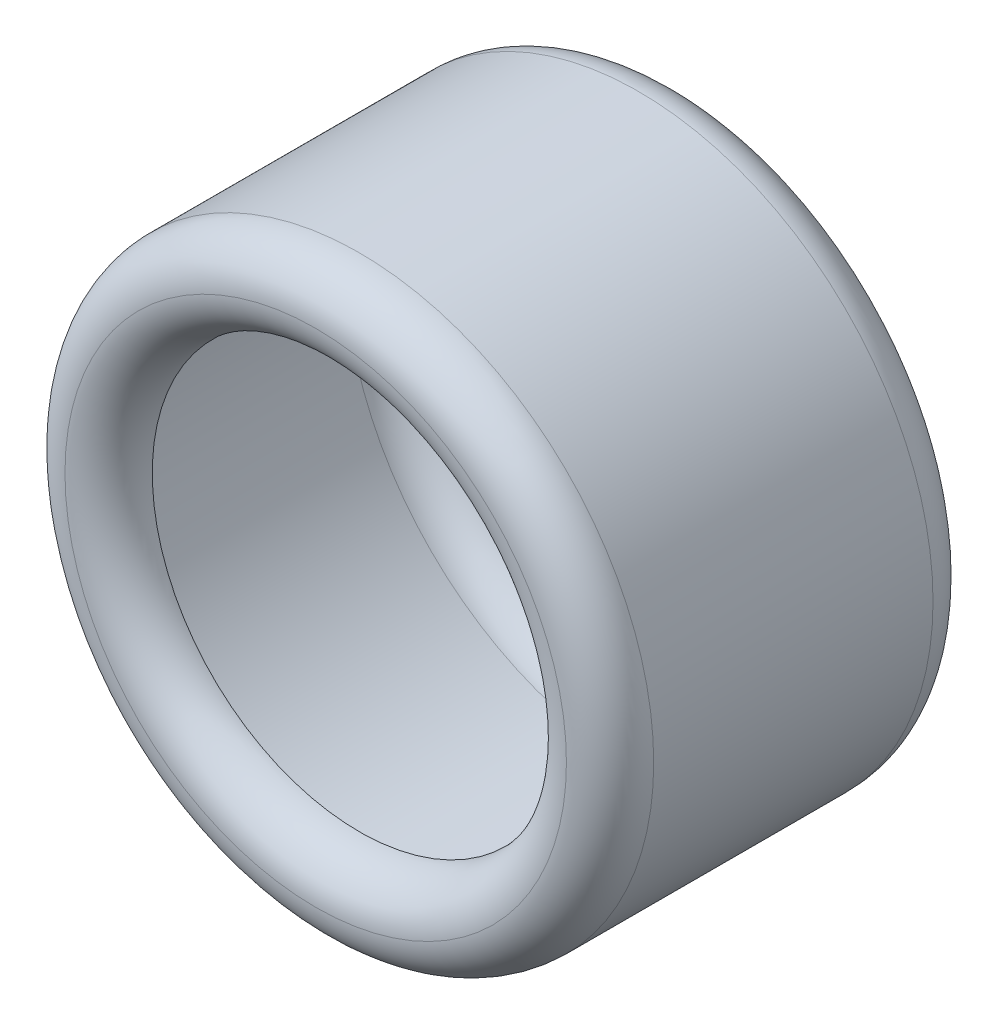
ISO-10303-21;
HEADER;
FILE_DESCRIPTION(('STEP AP214'),'2;1');
FILE_NAME('part.step','',(''),(''),'','','');
FILE_SCHEMA(('AUTOMOTIVE_DESIGN { 1 0 10303 214 1 1 1 1 }'));
ENDSEC;
DATA;
#1=APPLICATION_CONTEXT('core data for automotive mechanical design processes');
#2=APPLICATION_PROTOCOL_DEFINITION('international standard','automotive_design',2000,#1);
#3=PRODUCT_CONTEXT('',#1,'mechanical');
#4=PRODUCT('Part','Part','',(#3));
#5=PRODUCT_RELATED_PRODUCT_CATEGORY('part','',(#4));
#6=PRODUCT_DEFINITION_FORMATION('','',#4);
#7=PRODUCT_DEFINITION_CONTEXT('part definition',#1,'design');
#8=PRODUCT_DEFINITION('design','',#6,#7);
#9=PRODUCT_DEFINITION_SHAPE('','',#8);
#10=(LENGTH_UNIT() NAMED_UNIT(*) SI_UNIT(.MILLI.,.METRE.));
#11=(NAMED_UNIT(*) PLANE_ANGLE_UNIT() SI_UNIT($,.RADIAN.));
#12=(NAMED_UNIT(*) SI_UNIT($,.STERADIAN.) SOLID_ANGLE_UNIT());
#13=UNCERTAINTY_MEASURE_WITH_UNIT(LENGTH_MEASURE(1.E-05),#10,'distance_accuracy_value','');
#14=(GEOMETRIC_REPRESENTATION_CONTEXT(3) GLOBAL_UNCERTAINTY_ASSIGNED_CONTEXT((#13)) GLOBAL_UNIT_ASSIGNED_CONTEXT((#10,
#11,#12)) REPRESENTATION_CONTEXT('',''));
#15=CARTESIAN_POINT('',(0.,0.,0.));
#16=DIRECTION('',(0.,0.,1.));
#17=DIRECTION('',(1.,0.,0.));
#18=AXIS2_PLACEMENT_3D('',#15,#16,#17);
#19=CARTESIAN_POINT('',(0.,0.,106.68));
#20=DIRECTION('',(0.,0.,-1.));
#21=DIRECTION('',(-1.,0.,0.));
#22=AXIS2_PLACEMENT_3D('',#19,#20,#21);
#23=CYLINDRICAL_SURFACE('',#22,85.6640884557777);
#24=CARTESIAN_POINT('',(0.,0.,93.98));
#25=DIRECTION('',(0.,0.,1.));
#26=DIRECTION('',(1.,0.,0.));
#27=AXIS2_PLACEMENT_3D('',#24,#25,#26);
#28=CIRCLE('',#27,85.6640884557777);
#29=CARTESIAN_POINT('',(85.6640884557777,0.,93.98));
#30=VERTEX_POINT('',#29);
#31=EDGE_CURVE('E48',#30,#30,#28,.F.);
#32=ORIENTED_EDGE('',*,*,#31,.T.);
#33=EDGE_LOOP('',(#32));
#34=FACE_BOUND('',#33,.T.);
#35=CARTESIAN_POINT('',(0.,0.,12.7));
#36=DIRECTION('',(0.,0.,1.));
#37=DIRECTION('',(1.,0.,0.));
#38=AXIS2_PLACEMENT_3D('',#35,#36,#37);
#39=CIRCLE('',#38,85.6640884557777);
#40=CARTESIAN_POINT('',(85.6640884557777,0.,12.7));
#41=VERTEX_POINT('',#40);
#42=EDGE_CURVE('E52',#41,#41,#39,.T.);
#43=ORIENTED_EDGE('',*,*,#42,.T.);
#44=EDGE_LOOP('',(#43));
#45=FACE_BOUND('',#44,.T.);
#46=ADVANCED_FACE('F41',(#34,#45),#23,.T.);
#47=CARTESIAN_POINT('',(0.,0.,93.98));
#48=DIRECTION('',(0.,0.,1.));
#49=DIRECTION('',(1.,0.,0.));
#50=AXIS2_PLACEMENT_3D('',#47,#48,#49);
#51=TOROIDAL_SURFACE('',#50,72.9640884557777,12.7);
#52=ORIENTED_EDGE('',*,*,#31,.F.);
#53=EDGE_LOOP('',(#52));
#54=FACE_BOUND('',#53,.T.);
#55=CARTESIAN_POINT('',(0.,0.,106.68));
#56=DIRECTION('',(0.,0.,1.));
#57=DIRECTION('',(1.,0.,0.));
#58=AXIS2_PLACEMENT_3D('',#55,#56,#57);
#59=CIRCLE('',#58,72.9640884557777);
#60=CARTESIAN_POINT('',(72.9640884557777,0.,106.68));
#61=VERTEX_POINT('',#60);
#62=EDGE_CURVE('E56',#61,#61,#59,.T.);
#63=ORIENTED_EDGE('',*,*,#62,.F.);
#64=EDGE_LOOP('',(#63));
#65=FACE_BOUND('',#64,.T.);
#66=ADVANCED_FACE('F100',(#54,#65),#51,.T.);
#67=CARTESIAN_POINT('',(0.,0.,12.7));
#68=DIRECTION('',(0.,0.,1.));
#69=DIRECTION('',(1.,0.,0.));
#70=AXIS2_PLACEMENT_3D('',#67,#68,#69);
#71=TOROIDAL_SURFACE('',#70,72.9640884557777,12.7);
#72=CARTESIAN_POINT('',(0.,0.,0.));
#73=DIRECTION('',(0.,0.,1.));
#74=DIRECTION('',(1.,0.,0.));
#75=AXIS2_PLACEMENT_3D('',#72,#73,#74);
#76=CIRCLE('',#75,72.9640884557777);
#77=CARTESIAN_POINT('',(72.9640884557777,0.,0.));
#78=VERTEX_POINT('',#77);
#79=EDGE_CURVE('E11',#78,#78,#76,.F.);
#80=ORIENTED_EDGE('',*,*,#79,.F.);
#81=EDGE_LOOP('',(#80));
#82=FACE_BOUND('',#81,.T.);
#83=ORIENTED_EDGE('',*,*,#42,.F.);
#84=EDGE_LOOP('',(#83));
#85=FACE_BOUND('',#84,.T.);
#86=ADVANCED_FACE('F97',(#82,#85),#71,.T.);
#87=CARTESIAN_POINT('',(0.,0.,93.98));
#88=DIRECTION('',(0.,0.,1.));
#89=DIRECTION('',(1.,0.,0.));
#90=AXIS2_PLACEMENT_3D('',#87,#88,#89);
#91=TOROIDAL_SURFACE('',#90,72.9640884557777,12.7);
#92=ORIENTED_EDGE('',*,*,#62,.T.);
#93=EDGE_LOOP('',(#92));
#94=FACE_BOUND('',#93,.T.);
#95=CARTESIAN_POINT('',(0.,0.,93.98));
#96=DIRECTION('',(0.,0.,1.));
#97=DIRECTION('',(1.,0.,0.));
#98=AXIS2_PLACEMENT_3D('',#95,#96,#97);
#99=CIRCLE('',#98,60.2640884557777);
#100=CARTESIAN_POINT('',(60.2640884557777,0.,93.98));
#101=VERTEX_POINT('',#100);
#102=EDGE_CURVE('E67',#101,#101,#99,.T.);
#103=ORIENTED_EDGE('',*,*,#102,.F.);
#104=EDGE_LOOP('',(#103));
#105=FACE_BOUND('',#104,.T.);
#106=ADVANCED_FACE('F90',(#94,#105),#91,.T.);
#107=CARTESIAN_POINT('',(0.,0.,12.7));
#108=DIRECTION('',(0.,0.,1.));
#109=DIRECTION('',(1.,0.,0.));
#110=AXIS2_PLACEMENT_3D('',#107,#108,#109);
#111=TOROIDAL_SURFACE('',#110,72.9640884557777,12.7);
#112=CARTESIAN_POINT('',(0.,0.,12.7));
#113=DIRECTION('',(0.,0.,1.));
#114=DIRECTION('',(1.,0.,0.));
#115=AXIS2_PLACEMENT_3D('',#112,#113,#114);
#116=CIRCLE('',#115,60.2640884557777);
#117=CARTESIAN_POINT('',(60.2640884557777,0.,12.7));
#118=VERTEX_POINT('',#117);
#119=EDGE_CURVE('E71',#118,#118,#116,.F.);
#120=ORIENTED_EDGE('',*,*,#119,.F.);
#121=EDGE_LOOP('',(#120));
#122=FACE_BOUND('',#121,.T.);
#123=ORIENTED_EDGE('',*,*,#79,.T.);
#124=EDGE_LOOP('',(#123));
#125=FACE_BOUND('',#124,.T.);
#126=ADVANCED_FACE('F43',(#122,#125),#111,.T.);
#127=CARTESIAN_POINT('',(0.,0.,12.7));
#128=DIRECTION('',(0.,0.,-1.));
#129=DIRECTION('',(-1.,0.,0.));
#130=AXIS2_PLACEMENT_3D('',#127,#128,#129);
#131=PLANE('',#130);
#132=ORIENTED_EDGE('',*,*,#119,.T.);
#133=EDGE_LOOP('',(#132));
#134=FACE_BOUND('',#133,.T.);
#135=CARTESIAN_POINT('',(0.,0.,12.7));
#136=DIRECTION('',(0.,0.,1.));
#137=DIRECTION('',(1.,0.,0.));
#138=AXIS2_PLACEMENT_3D('',#135,#136,#137);
#139=CIRCLE('',#138,60.5180884557777);
#140=CARTESIAN_POINT('',(60.5180884557777,0.,12.7));
#141=VERTEX_POINT('',#140);
#142=EDGE_CURVE('E61',#141,#141,#139,.F.);
#143=ORIENTED_EDGE('',*,*,#142,.F.);
#144=EDGE_LOOP('',(#143));
#145=FACE_BOUND('',#144,.T.);
#146=ADVANCED_FACE('F86',(#134,#145),#131,.F.);
#147=CARTESIAN_POINT('',(0.,0.,93.98));
#148=DIRECTION('',(0.,0.,-1.));
#149=DIRECTION('',(-1.,0.,0.));
#150=AXIS2_PLACEMENT_3D('',#147,#148,#149);
#151=PLANE('',#150);
#152=ORIENTED_EDGE('',*,*,#102,.T.);
#153=EDGE_LOOP('',(#152));
#154=FACE_BOUND('',#153,.T.);
#155=CARTESIAN_POINT('',(0.,0.,93.98));
#156=DIRECTION('',(0.,0.,1.));
#157=DIRECTION('',(1.,0.,0.));
#158=AXIS2_PLACEMENT_3D('',#155,#156,#157);
#159=CIRCLE('',#158,60.5180884557777);
#160=CARTESIAN_POINT('',(60.5180884557777,0.,93.98));
#161=VERTEX_POINT('',#160);
#162=EDGE_CURVE('E64',#161,#161,#159,.T.);
#163=ORIENTED_EDGE('',*,*,#162,.F.);
#164=EDGE_LOOP('',(#163));
#165=FACE_BOUND('',#164,.T.);
#166=ADVANCED_FACE('F95',(#154,#165),#151,.T.);
#167=CARTESIAN_POINT('',(0.,0.,106.68));
#168=DIRECTION('',(0.,0.,-1.));
#169=DIRECTION('',(-1.,0.,0.));
#170=AXIS2_PLACEMENT_3D('',#167,#168,#169);
#171=CYLINDRICAL_SURFACE('',#170,85.4100884557777);
#172=CARTESIAN_POINT('',(0.,0.,93.98));
#173=DIRECTION('',(0.,0.,-1.));
#174=DIRECTION('',(-1.,0.,0.));
#175=AXIS2_PLACEMENT_3D('',#172,#173,#174);
#176=CIRCLE('',#175,85.4100884557777);
#177=CARTESIAN_POINT('',(-85.4100884557777,0.,93.98));
#178=VERTEX_POINT('',#177);
#179=EDGE_CURVE('E72',#178,#178,#176,.T.);
#180=ORIENTED_EDGE('',*,*,#179,.F.);
#181=EDGE_LOOP('',(#180));
#182=FACE_BOUND('',#181,.T.);
#183=CARTESIAN_POINT('',(0.,0.,12.7));
#184=DIRECTION('',(0.,0.,-1.));
#185=DIRECTION('',(-1.,0.,0.));
#186=AXIS2_PLACEMENT_3D('',#183,#184,#185);
#187=CIRCLE('',#186,85.4100884557777);
#188=CARTESIAN_POINT('',(-85.4100884557777,0.,12.7));
#189=VERTEX_POINT('',#188);
#190=EDGE_CURVE('E76',#189,#189,#187,.F.);
#191=ORIENTED_EDGE('',*,*,#190,.F.);
#192=EDGE_LOOP('',(#191));
#193=FACE_BOUND('',#192,.T.);
#194=ADVANCED_FACE('F145',(#182,#193),#171,.F.);
#195=CARTESIAN_POINT('',(0.,0.,93.98));
#196=DIRECTION('',(0.,0.,1.));
#197=DIRECTION('',(1.,0.,0.));
#198=AXIS2_PLACEMENT_3D('',#195,#196,#197);
#199=TOROIDAL_SURFACE('',#198,72.9640884557777,12.446);
#200=ORIENTED_EDGE('',*,*,#179,.T.);
#201=EDGE_LOOP('',(#200));
#202=FACE_BOUND('',#201,.T.);
#203=CARTESIAN_POINT('',(0.,0.,106.426));
#204=DIRECTION('',(0.,0.,1.));
#205=DIRECTION('',(1.,0.,0.));
#206=AXIS2_PLACEMENT_3D('',#203,#204,#205);
#207=CIRCLE('',#206,72.9640884557777);
#208=CARTESIAN_POINT('',(72.9640884557777,0.,106.426));
#209=VERTEX_POINT('',#208);
#210=EDGE_CURVE('E73',#209,#209,#207,.T.);
#211=ORIENTED_EDGE('',*,*,#210,.T.);
#212=EDGE_LOOP('',(#211));
#213=FACE_BOUND('',#212,.T.);
#214=ADVANCED_FACE('F154',(#202,#213),#199,.F.);
#215=CARTESIAN_POINT('',(0.,0.,12.7));
#216=DIRECTION('',(0.,0.,1.));
#217=DIRECTION('',(1.,0.,0.));
#218=AXIS2_PLACEMENT_3D('',#215,#216,#217);
#219=TOROIDAL_SURFACE('',#218,72.9640884557777,12.446);
#220=CARTESIAN_POINT('',(0.,0.,0.254000000000004));
#221=DIRECTION('',(0.,0.,1.));
#222=DIRECTION('',(1.,0.,0.));
#223=AXIS2_PLACEMENT_3D('',#220,#221,#222);
#224=CIRCLE('',#223,72.9640884557777);
#225=CARTESIAN_POINT('',(72.9640884557777,0.,0.254000000000004));
#226=VERTEX_POINT('',#225);
#227=EDGE_CURVE('E68',#226,#226,#224,.F.);
#228=ORIENTED_EDGE('',*,*,#227,.T.);
#229=EDGE_LOOP('',(#228));
#230=FACE_BOUND('',#229,.T.);
#231=ORIENTED_EDGE('',*,*,#190,.T.);
#232=EDGE_LOOP('',(#231));
#233=FACE_BOUND('',#232,.T.);
#234=ADVANCED_FACE('F164',(#230,#233),#219,.F.);
#235=CARTESIAN_POINT('',(0.,0.,93.98));
#236=DIRECTION('',(0.,0.,1.));
#237=DIRECTION('',(1.,0.,0.));
#238=AXIS2_PLACEMENT_3D('',#235,#236,#237);
#239=TOROIDAL_SURFACE('',#238,72.9640884557777,12.446);
#240=ORIENTED_EDGE('',*,*,#210,.F.);
#241=EDGE_LOOP('',(#240));
#242=FACE_BOUND('',#241,.T.);
#243=ORIENTED_EDGE('',*,*,#162,.T.);
#244=EDGE_LOOP('',(#243));
#245=FACE_BOUND('',#244,.T.);
#246=ADVANCED_FACE('F174',(#242,#245),#239,.F.);
#247=CARTESIAN_POINT('',(0.,0.,12.7));
#248=DIRECTION('',(0.,0.,1.));
#249=DIRECTION('',(1.,0.,0.));
#250=AXIS2_PLACEMENT_3D('',#247,#248,#249);
#251=TOROIDAL_SURFACE('',#250,72.9640884557777,12.446);
#252=ORIENTED_EDGE('',*,*,#142,.T.);
#253=EDGE_LOOP('',(#252));
#254=FACE_BOUND('',#253,.T.);
#255=ORIENTED_EDGE('',*,*,#227,.F.);
#256=EDGE_LOOP('',(#255));
#257=FACE_BOUND('',#256,.T.);
#258=ADVANCED_FACE('F109',(#254,#257),#251,.F.);
#259=CLOSED_SHELL('',(#46,#66,#86,#106,#126,#146,#166,#194,#214,#234,#246,#258));
#260=MANIFOLD_SOLID_BREP('B2',#259);
#261=ADVANCED_BREP_SHAPE_REPRESENTATION('',(#18,#260),#14);
#262=SHAPE_DEFINITION_REPRESENTATION(#9,#261);
ENDSEC;
END-ISO-10303-21;
